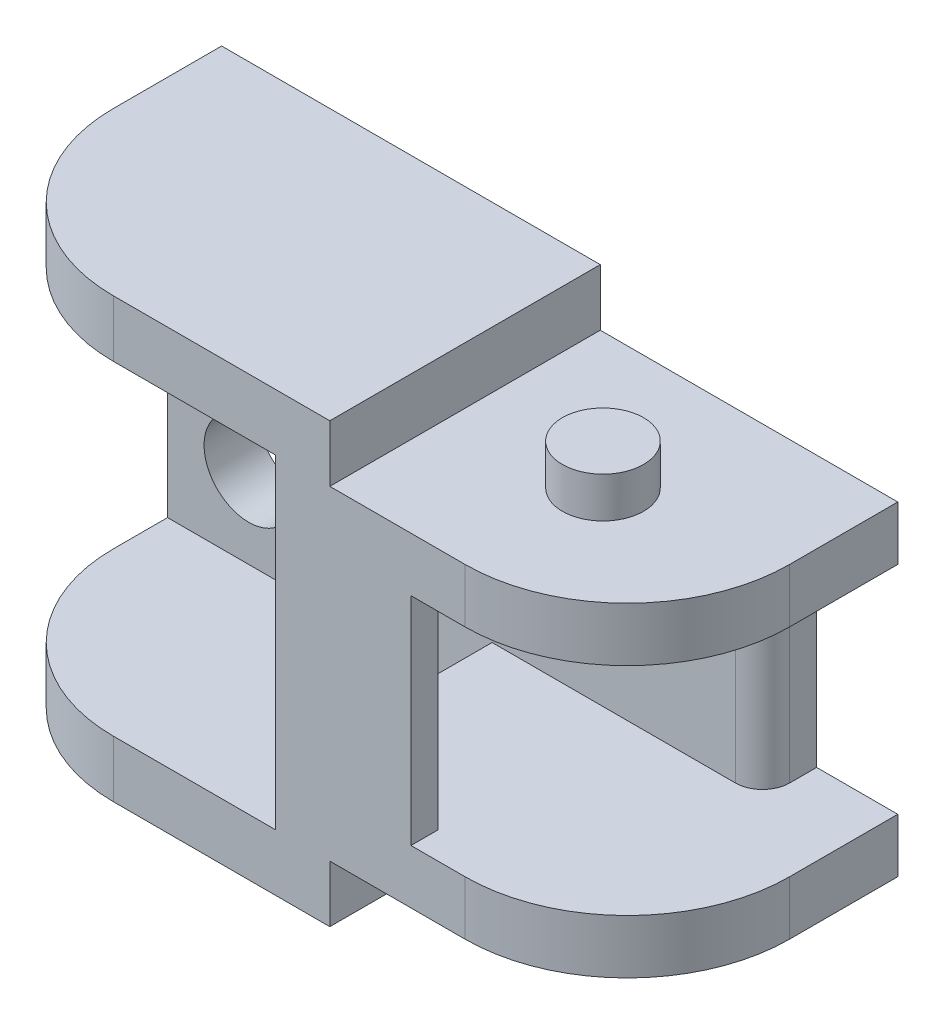
ISO-10303-21;
HEADER;
FILE_DESCRIPTION(('STEP AP214'),'2;1');
FILE_NAME('part.step','',(''),(''),'','','');
FILE_SCHEMA(('AUTOMOTIVE_DESIGN { 1 0 10303 214 1 1 1 1 }'));
ENDSEC;
DATA;
#1=APPLICATION_CONTEXT('core data for automotive mechanical design processes');
#2=APPLICATION_PROTOCOL_DEFINITION('international standard','automotive_design',2000,#1);
#3=PRODUCT_CONTEXT('',#1,'mechanical');
#4=PRODUCT('Part','Part','',(#3));
#5=PRODUCT_RELATED_PRODUCT_CATEGORY('part','',(#4));
#6=PRODUCT_DEFINITION_FORMATION('','',#4);
#7=PRODUCT_DEFINITION_CONTEXT('part definition',#1,'design');
#8=PRODUCT_DEFINITION('design','',#6,#7);
#9=PRODUCT_DEFINITION_SHAPE('','',#8);
#10=(LENGTH_UNIT() NAMED_UNIT(*) SI_UNIT(.MILLI.,.METRE.));
#11=(NAMED_UNIT(*) PLANE_ANGLE_UNIT() SI_UNIT($,.RADIAN.));
#12=(NAMED_UNIT(*) SI_UNIT($,.STERADIAN.) SOLID_ANGLE_UNIT());
#13=UNCERTAINTY_MEASURE_WITH_UNIT(LENGTH_MEASURE(1.E-05),#10,'distance_accuracy_value','');
#14=(GEOMETRIC_REPRESENTATION_CONTEXT(3) GLOBAL_UNCERTAINTY_ASSIGNED_CONTEXT((#13)) GLOBAL_UNIT_ASSIGNED_CONTEXT((#10,
#11,#12)) REPRESENTATION_CONTEXT('',''));
#15=CARTESIAN_POINT('',(0.,0.,0.));
#16=DIRECTION('',(0.,0.,1.));
#17=DIRECTION('',(1.,0.,0.));
#18=AXIS2_PLACEMENT_3D('',#15,#16,#17);
#19=CARTESIAN_POINT('',(24.,-2.1,10.));
#20=DIRECTION('',(0.,1.,0.));
#21=DIRECTION('',(-1.,0.,0.));
#22=AXIS2_PLACEMENT_3D('',#19,#20,#21);
#23=PLANE('',#22);
#24=DIRECTION('',(1.,0.,0.));
#25=VECTOR('',#24,1.);
#26=CARTESIAN_POINT('',(11.,-2.1,9.));
#27=LINE('',#26,#25);
#28=CARTESIAN_POINT('',(11.,-2.1,9.));
#29=VERTEX_POINT('',#28);
#30=CARTESIAN_POINT('',(16.,-2.1,9.));
#31=VERTEX_POINT('',#30);
#32=EDGE_CURVE('E360',#29,#31,#27,.T.);
#33=ORIENTED_EDGE('',*,*,#32,.F.);
#34=DIRECTION('',(0.,0.,-1.));
#35=VECTOR('',#34,1.);
#36=CARTESIAN_POINT('',(11.,-2.1,10.));
#37=LINE('',#36,#35);
#38=CARTESIAN_POINT('',(11.,-2.1,2.));
#39=VERTEX_POINT('',#38);
#40=EDGE_CURVE('E263',#29,#39,#37,.T.);
#41=ORIENTED_EDGE('',*,*,#40,.T.);
#42=DIRECTION('',(-1.,0.,0.));
#43=VECTOR('',#42,1.);
#44=CARTESIAN_POINT('',(24.,-2.1,2.));
#45=LINE('',#44,#43);
#46=CARTESIAN_POINT('',(20.,-2.1,2.));
#47=VERTEX_POINT('',#46);
#48=EDGE_CURVE('E374',#47,#39,#45,.T.);
#49=ORIENTED_EDGE('',*,*,#48,.F.);
#50=CARTESIAN_POINT('',(20.,-2.1,1.));
#51=DIRECTION('',(0.,1.,0.));
#52=DIRECTION('',(-1.,0.,0.));
#53=AXIS2_PLACEMENT_3D('',#50,#51,#52);
#54=CIRCLE('',#53,1.);
#55=CARTESIAN_POINT('',(21.,-2.1,1.));
#56=VERTEX_POINT('',#55);
#57=EDGE_CURVE('E50',#47,#56,#54,.T.);
#58=ORIENTED_EDGE('',*,*,#57,.T.);
#59=DIRECTION('',(0.,0.,1.));
#60=VECTOR('',#59,1.);
#61=CARTESIAN_POINT('',(21.,-2.1,0.));
#62=LINE('',#61,#60);
#63=CARTESIAN_POINT('',(21.,-2.1,0.));
#64=VERTEX_POINT('',#63);
#65=EDGE_CURVE('E371',#64,#56,#62,.T.);
#66=ORIENTED_EDGE('',*,*,#65,.F.);
#67=DIRECTION('',(1.,0.,0.));
#68=VECTOR('',#67,1.);
#69=CARTESIAN_POINT('',(24.,-2.1,0.));
#70=LINE('',#69,#68);
#71=CARTESIAN_POINT('',(24.,-2.1,0.));
#72=VERTEX_POINT('',#71);
#73=EDGE_CURVE('E400',#64,#72,#70,.T.);
#74=ORIENTED_EDGE('',*,*,#73,.T.);
#75=DIRECTION('',(0.,0.,-1.));
#76=VECTOR('',#75,1.);
#77=CARTESIAN_POINT('',(24.,-2.1,10.));
#78=LINE('',#77,#76);
#79=CARTESIAN_POINT('',(24.,-2.1,4.));
#80=VERTEX_POINT('',#79);
#81=EDGE_CURVE('E426',#80,#72,#78,.T.);
#82=ORIENTED_EDGE('',*,*,#81,.F.);
#83=CARTESIAN_POINT('',(18.,-2.1,4.));
#84=DIRECTION('',(0.,1.,0.));
#85=DIRECTION('',(-1.,0.,0.));
#86=AXIS2_PLACEMENT_3D('',#83,#84,#85);
#87=CIRCLE('',#86,6.);
#88=CARTESIAN_POINT('',(18.,-2.1,10.));
#89=VERTEX_POINT('',#88);
#90=EDGE_CURVE('E444',#80,#89,#87,.F.);
#91=ORIENTED_EDGE('',*,*,#90,.T.);
#92=DIRECTION('',(1.,0.,0.));
#93=VECTOR('',#92,1.);
#94=CARTESIAN_POINT('',(24.,-2.1,10.));
#95=LINE('',#94,#93);
#96=CARTESIAN_POINT('',(16.,-2.1,10.));
#97=VERTEX_POINT('',#96);
#98=EDGE_CURVE('E385',#97,#89,#95,.T.);
#99=ORIENTED_EDGE('',*,*,#98,.F.);
#100=DIRECTION('',(0.,0.,1.));
#101=VECTOR('',#100,1.);
#102=CARTESIAN_POINT('',(16.,-2.1,9.));
#103=LINE('',#102,#101);
#104=EDGE_CURVE('E357',#31,#97,#103,.T.);
#105=ORIENTED_EDGE('',*,*,#104,.F.);
#106=EDGE_LOOP('',(#33,#41,#49,#58,#66,#74,#82,#91,#99,#105));
#107=FACE_BOUND('',#106,.T.);
#108=ADVANCED_FACE('F41',(#107),#23,.F.);
#109=CARTESIAN_POINT('',(-1.,-2.1,10.));
#110=DIRECTION('',(1.,0.,0.));
#111=DIRECTION('',(0.,0.,-1.));
#112=AXIS2_PLACEMENT_3D('',#109,#110,#111);
#113=PLANE('',#112);
#114=DIRECTION('',(0.,0.,-1.));
#115=VECTOR('',#114,1.);
#116=CARTESIAN_POINT('',(-1.,-14.2,10.));
#117=LINE('',#116,#115);
#118=CARTESIAN_POINT('',(-1.,-14.2,4.));
#119=VERTEX_POINT('',#118);
#120=CARTESIAN_POINT('',(-1.,-14.2,0.));
#121=VERTEX_POINT('',#120);
#122=EDGE_CURVE('E448',#119,#121,#117,.T.);
#123=ORIENTED_EDGE('',*,*,#122,.F.);
#124=DIRECTION('',(0.,-1.,0.));
#125=VECTOR('',#124,1.);
#126=CARTESIAN_POINT('',(-1.,-2.1,4.));
#127=LINE('',#126,#125);
#128=CARTESIAN_POINT('',(-1.,-12.1,4.));
#129=VERTEX_POINT('',#128);
#130=EDGE_CURVE('E471',#119,#129,#127,.F.);
#131=ORIENTED_EDGE('',*,*,#130,.T.);
#132=DIRECTION('',(0.,0.,-1.));
#133=VECTOR('',#132,1.);
#134=CARTESIAN_POINT('',(-1.,-12.1,10.));
#135=LINE('',#134,#133);
#136=CARTESIAN_POINT('',(-1.,-12.1,2.));
#137=VERTEX_POINT('',#136);
#138=EDGE_CURVE('E267',#129,#137,#135,.T.);
#139=ORIENTED_EDGE('',*,*,#138,.T.);
#140=DIRECTION('',(0.,1.,0.));
#141=VECTOR('',#140,1.);
#142=CARTESIAN_POINT('',(-1.,-2.1,2.));
#143=LINE('',#142,#141);
#144=CARTESIAN_POINT('',(-1.,-0.0999999999999994,2.));
#145=VERTEX_POINT('',#144);
#146=EDGE_CURVE('E379',#137,#145,#143,.T.);
#147=ORIENTED_EDGE('',*,*,#146,.T.);
#148=DIRECTION('',(0.,0.,1.));
#149=VECTOR('',#148,1.);
#150=CARTESIAN_POINT('',(-1.,-0.0999999999999994,10.));
#151=LINE('',#150,#149);
#152=CARTESIAN_POINT('',(-1.,-0.0999999999999994,4.));
#153=VERTEX_POINT('',#152);
#154=EDGE_CURVE('E270',#145,#153,#151,.T.);
#155=ORIENTED_EDGE('',*,*,#154,.T.);
#156=DIRECTION('',(0.,-1.,0.));
#157=VECTOR('',#156,1.);
#158=CARTESIAN_POINT('',(-1.,-2.1,4.));
#159=LINE('',#158,#157);
#160=CARTESIAN_POINT('',(-1.,2.,4.));
#161=VERTEX_POINT('',#160);
#162=EDGE_CURVE('E468',#153,#161,#159,.F.);
#163=ORIENTED_EDGE('',*,*,#162,.T.);
#164=DIRECTION('',(0.,0.,1.));
#165=VECTOR('',#164,1.);
#166=CARTESIAN_POINT('',(-1.,2.,10.));
#167=LINE('',#166,#165);
#168=CARTESIAN_POINT('',(-1.,2.,0.));
#169=VERTEX_POINT('',#168);
#170=EDGE_CURVE('E274',#169,#161,#167,.T.);
#171=ORIENTED_EDGE('',*,*,#170,.F.);
#172=DIRECTION('',(0.,-1.,0.));
#173=VECTOR('',#172,1.);
#174=CARTESIAN_POINT('',(-1.,0.,0.));
#175=LINE('',#174,#173);
#176=EDGE_CURVE('E384',#169,#121,#175,.T.);
#177=ORIENTED_EDGE('',*,*,#176,.T.);
#178=EDGE_LOOP('',(#123,#131,#139,#147,#155,#163,#171,#177));
#179=FACE_BOUND('',#178,.T.);
#180=ADVANCED_FACE('F570',(#179),#113,.F.);
#181=CARTESIAN_POINT('',(24.,-0.0999999999999997,10.));
#182=DIRECTION('',(-1.,0.,0.));
#183=DIRECTION('',(0.,0.,1.));
#184=AXIS2_PLACEMENT_3D('',#181,#182,#183);
#185=PLANE('',#184);
#186=DIRECTION('',(0.,0.,-1.));
#187=VECTOR('',#186,1.);
#188=CARTESIAN_POINT('',(24.,-0.0999999999999997,10.));
#189=LINE('',#188,#187);
#190=CARTESIAN_POINT('',(24.,-0.0999999999999997,4.));
#191=VERTEX_POINT('',#190);
#192=CARTESIAN_POINT('',(24.,-0.0999999999999997,0.));
#193=VERTEX_POINT('',#192);
#194=EDGE_CURVE('E423',#191,#193,#189,.T.);
#195=ORIENTED_EDGE('',*,*,#194,.F.);
#196=DIRECTION('',(0.,1.,0.));
#197=VECTOR('',#196,1.);
#198=CARTESIAN_POINT('',(24.,-0.0999999999999997,4.));
#199=LINE('',#198,#197);
#200=EDGE_CURVE('E441',#191,#80,#199,.F.);
#201=ORIENTED_EDGE('',*,*,#200,.T.);
#202=ORIENTED_EDGE('',*,*,#81,.T.);
#203=DIRECTION('',(0.,1.,0.));
#204=VECTOR('',#203,1.);
#205=CARTESIAN_POINT('',(24.,-0.0999999999999997,0.));
#206=LINE('',#205,#204);
#207=EDGE_CURVE('E403',#72,#193,#206,.T.);
#208=ORIENTED_EDGE('',*,*,#207,.T.);
#209=EDGE_LOOP('',(#195,#201,#202,#208));
#210=FACE_BOUND('',#209,.T.);
#211=ADVANCED_FACE('F546',(#210),#185,.F.);
#212=CARTESIAN_POINT('',(13.,-0.0999999999999997,10.));
#213=DIRECTION('',(0.,-1.,0.));
#214=DIRECTION('',(0.,0.,-1.));
#215=AXIS2_PLACEMENT_3D('',#212,#213,#214);
#216=PLANE('',#215);
#217=CARTESIAN_POINT('',(18.1,-0.0999999999999998,5.));
#218=DIRECTION('',(0.,-1.,0.));
#219=DIRECTION('',(0.,0.,-1.));
#220=AXIS2_PLACEMENT_3D('',#217,#218,#219);
#221=CIRCLE('',#220,1.5);
#222=CARTESIAN_POINT('',(18.1,-0.0999999999999998,3.5));
#223=VERTEX_POINT('',#222);
#224=EDGE_CURVE('E430',#223,#223,#221,.F.);
#225=ORIENTED_EDGE('',*,*,#224,.F.);
#226=EDGE_LOOP('',(#225));
#227=FACE_BOUND('',#226,.T.);
#228=DIRECTION('',(-1.,0.,0.));
#229=VECTOR('',#228,1.);
#230=CARTESIAN_POINT('',(13.,-0.0999999999999997,10.));
#231=LINE('',#230,#229);
#232=CARTESIAN_POINT('',(18.,-0.0999999999999997,10.));
#233=VERTEX_POINT('',#232);
#234=CARTESIAN_POINT('',(13.,-0.0999999999999997,10.));
#235=VERTEX_POINT('',#234);
#236=EDGE_CURVE('E388',#233,#235,#231,.T.);
#237=ORIENTED_EDGE('',*,*,#236,.F.);
#238=CARTESIAN_POINT('',(18.,-0.0999999999999997,4.));
#239=DIRECTION('',(0.,-1.,0.));
#240=DIRECTION('',(0.,0.,-1.));
#241=AXIS2_PLACEMENT_3D('',#238,#239,#240);
#242=CIRCLE('',#241,6.);
#243=EDGE_CURVE('E438',#233,#191,#242,.F.);
#244=ORIENTED_EDGE('',*,*,#243,.T.);
#245=ORIENTED_EDGE('',*,*,#194,.T.);
#246=DIRECTION('',(-1.,0.,0.));
#247=VECTOR('',#246,1.);
#248=CARTESIAN_POINT('',(13.,-0.0999999999999997,0.));
#249=LINE('',#248,#247);
#250=CARTESIAN_POINT('',(13.,-0.0999999999999997,0.));
#251=VERTEX_POINT('',#250);
#252=EDGE_CURVE('E407',#193,#251,#249,.T.);
#253=ORIENTED_EDGE('',*,*,#252,.T.);
#254=DIRECTION('',(0.,0.,-1.));
#255=VECTOR('',#254,1.);
#256=CARTESIAN_POINT('',(13.,-0.0999999999999997,10.));
#257=LINE('',#256,#255);
#258=EDGE_CURVE('E419',#235,#251,#257,.T.);
#259=ORIENTED_EDGE('',*,*,#258,.F.);
#260=EDGE_LOOP('',(#237,#244,#245,#253,#259));
#261=FACE_BOUND('',#260,.T.);
#262=ADVANCED_FACE('F819',(#227,#261),#216,.F.);
#263=CARTESIAN_POINT('',(13.,2.,10.));
#264=DIRECTION('',(-1.,0.,0.));
#265=DIRECTION('',(0.,0.,1.));
#266=AXIS2_PLACEMENT_3D('',#263,#264,#265);
#267=PLANE('',#266);
#268=DIRECTION('',(0.,1.,0.));
#269=VECTOR('',#268,1.);
#270=CARTESIAN_POINT('',(13.,2.,0.));
#271=LINE('',#270,#269);
#272=CARTESIAN_POINT('',(13.,2.,0.));
#273=VERTEX_POINT('',#272);
#274=EDGE_CURVE('E410',#251,#273,#271,.T.);
#275=ORIENTED_EDGE('',*,*,#274,.T.);
#276=DIRECTION('',(0.,0.,-1.));
#277=VECTOR('',#276,1.);
#278=CARTESIAN_POINT('',(13.,2.,10.));
#279=LINE('',#278,#277);
#280=CARTESIAN_POINT('',(13.,2.,10.));
#281=VERTEX_POINT('',#280);
#282=EDGE_CURVE('E399',#281,#273,#279,.T.);
#283=ORIENTED_EDGE('',*,*,#282,.F.);
#284=DIRECTION('',(0.,1.,0.));
#285=VECTOR('',#284,1.);
#286=CARTESIAN_POINT('',(13.,2.,10.));
#287=LINE('',#286,#285);
#288=EDGE_CURVE('E392',#235,#281,#287,.T.);
#289=ORIENTED_EDGE('',*,*,#288,.F.);
#290=ORIENTED_EDGE('',*,*,#258,.T.);
#291=EDGE_LOOP('',(#275,#283,#289,#290));
#292=FACE_BOUND('',#291,.T.);
#293=ADVANCED_FACE('F583',(#292),#267,.F.);
#294=CARTESIAN_POINT('',(0.,2.,10.));
#295=DIRECTION('',(0.,-1.,0.));
#296=DIRECTION('',(1.,0.,0.));
#297=AXIS2_PLACEMENT_3D('',#294,#295,#296);
#298=PLANE('',#297);
#299=ORIENTED_EDGE('',*,*,#170,.T.);
#300=CARTESIAN_POINT('',(5.,2.,4.));
#301=DIRECTION('',(0.,-1.,0.));
#302=DIRECTION('',(1.,0.,0.));
#303=AXIS2_PLACEMENT_3D('',#300,#301,#302);
#304=CIRCLE('',#303,6.);
#305=CARTESIAN_POINT('',(5.,2.,10.));
#306=VERTEX_POINT('',#305);
#307=EDGE_CURVE('E479',#161,#306,#304,.F.);
#308=ORIENTED_EDGE('',*,*,#307,.T.);
#309=DIRECTION('',(-1.,0.,0.));
#310=VECTOR('',#309,1.);
#311=CARTESIAN_POINT('',(0.,2.,10.));
#312=LINE('',#311,#310);
#313=EDGE_CURVE('E395',#281,#306,#312,.T.);
#314=ORIENTED_EDGE('',*,*,#313,.F.);
#315=ORIENTED_EDGE('',*,*,#282,.T.);
#316=DIRECTION('',(-1.,0.,0.));
#317=VECTOR('',#316,1.);
#318=CARTESIAN_POINT('',(0.,2.,0.));
#319=LINE('',#318,#317);
#320=EDGE_CURVE('E389',#273,#169,#319,.T.);
#321=ORIENTED_EDGE('',*,*,#320,.T.);
#322=EDGE_LOOP('',(#299,#308,#314,#315,#321));
#323=FACE_BOUND('',#322,.T.);
#324=ADVANCED_FACE('F578',(#323),#298,.F.);
#325=CARTESIAN_POINT('',(0.,0.,10.));
#326=DIRECTION('',(0.,0.,-1.));
#327=DIRECTION('',(-1.,0.,0.));
#328=AXIS2_PLACEMENT_3D('',#325,#326,#327);
#329=PLANE('',#328);
#330=DIRECTION('',(-1.,0.,0.));
#331=VECTOR('',#330,1.);
#332=CARTESIAN_POINT('',(0.,-12.1,10.));
#333=LINE('',#332,#331);
#334=CARTESIAN_POINT('',(11.,-12.1,10.));
#335=VERTEX_POINT('',#334);
#336=CARTESIAN_POINT('',(5.,-12.1,10.));
#337=VERTEX_POINT('',#336);
#338=EDGE_CURVE('E208',#335,#337,#333,.T.);
#339=ORIENTED_EDGE('',*,*,#338,.T.);
#340=DIRECTION('',(0.,-1.,0.));
#341=VECTOR('',#340,1.);
#342=CARTESIAN_POINT('',(5.,0.,10.));
#343=LINE('',#342,#341);
#344=CARTESIAN_POINT('',(5.,-14.2,10.));
#345=VERTEX_POINT('',#344);
#346=EDGE_CURVE('E462',#337,#345,#343,.T.);
#347=ORIENTED_EDGE('',*,*,#346,.T.);
#348=DIRECTION('',(-1.,0.,0.));
#349=VECTOR('',#348,1.);
#350=CARTESIAN_POINT('',(0.,-14.2,10.));
#351=LINE('',#350,#349);
#352=CARTESIAN_POINT('',(13.,-14.2,10.));
#353=VERTEX_POINT('',#352);
#354=EDGE_CURVE('E302',#353,#345,#351,.T.);
#355=ORIENTED_EDGE('',*,*,#354,.F.);
#356=DIRECTION('',(0.,-1.,0.));
#357=VECTOR('',#356,1.);
#358=CARTESIAN_POINT('',(13.,-14.2,10.));
#359=LINE('',#358,#357);
#360=CARTESIAN_POINT('',(13.,-12.1,10.));
#361=VERTEX_POINT('',#360);
#362=EDGE_CURVE('E298',#361,#353,#359,.T.);
#363=ORIENTED_EDGE('',*,*,#362,.F.);
#364=DIRECTION('',(-1.,0.,0.));
#365=VECTOR('',#364,1.);
#366=CARTESIAN_POINT('',(13.,-12.1,10.));
#367=LINE('',#366,#365);
#368=CARTESIAN_POINT('',(18.,-12.1,10.));
#369=VERTEX_POINT('',#368);
#370=EDGE_CURVE('E293',#369,#361,#367,.T.);
#371=ORIENTED_EDGE('',*,*,#370,.F.);
#372=DIRECTION('',(0.,-1.,0.));
#373=VECTOR('',#372,1.);
#374=CARTESIAN_POINT('',(18.,-12.2,10.));
#375=LINE('',#374,#373);
#376=CARTESIAN_POINT('',(18.,-10.1,10.));
#377=VERTEX_POINT('',#376);
#378=EDGE_CURVE('E344',#377,#369,#375,.T.);
#379=ORIENTED_EDGE('',*,*,#378,.F.);
#380=DIRECTION('',(1.,0.,0.));
#381=VECTOR('',#380,1.);
#382=CARTESIAN_POINT('',(24.,-10.1,10.));
#383=LINE('',#382,#381);
#384=CARTESIAN_POINT('',(16.,-10.1,10.));
#385=VERTEX_POINT('',#384);
#386=EDGE_CURVE('E290',#385,#377,#383,.T.);
#387=ORIENTED_EDGE('',*,*,#386,.F.);
#388=DIRECTION('',(0.,1.,0.));
#389=VECTOR('',#388,1.);
#390=CARTESIAN_POINT('',(16.,-6.1,10.));
#391=LINE('',#390,#389);
#392=EDGE_CURVE('E367',#385,#97,#391,.T.);
#393=ORIENTED_EDGE('',*,*,#392,.T.);
#394=ORIENTED_EDGE('',*,*,#98,.T.);
#395=DIRECTION('',(0.,1.,0.));
#396=VECTOR('',#395,1.);
#397=CARTESIAN_POINT('',(18.,0.,10.));
#398=LINE('',#397,#396);
#399=EDGE_CURVE('E434',#89,#233,#398,.T.);
#400=ORIENTED_EDGE('',*,*,#399,.T.);
#401=ORIENTED_EDGE('',*,*,#236,.T.);
#402=ORIENTED_EDGE('',*,*,#288,.T.);
#403=ORIENTED_EDGE('',*,*,#313,.T.);
#404=DIRECTION('',(0.,-1.,0.));
#405=VECTOR('',#404,1.);
#406=CARTESIAN_POINT('',(5.,0.,10.));
#407=LINE('',#406,#405);
#408=CARTESIAN_POINT('',(5.,-0.0999999999999996,10.));
#409=VERTEX_POINT('',#408);
#410=EDGE_CURVE('E221',#306,#409,#407,.T.);
#411=ORIENTED_EDGE('',*,*,#410,.T.);
#412=DIRECTION('',(-1.,0.,0.));
#413=VECTOR('',#412,1.);
#414=CARTESIAN_POINT('',(-3.18835081881624,-0.0999999999999994,10.));
#415=LINE('',#414,#413);
#416=CARTESIAN_POINT('',(11.,-0.0999999999999997,10.));
#417=VERTEX_POINT('',#416);
#418=EDGE_CURVE('E241',#417,#409,#415,.T.);
#419=ORIENTED_EDGE('',*,*,#418,.F.);
#420=DIRECTION('',(0.,1.,0.));
#421=VECTOR('',#420,1.);
#422=CARTESIAN_POINT('',(11.,-12.1,10.));
#423=LINE('',#422,#421);
#424=EDGE_CURVE('E229',#335,#417,#423,.T.);
#425=ORIENTED_EDGE('',*,*,#424,.F.);
#426=EDGE_LOOP('',(#339,#347,#355,#363,#371,#379,#387,#393,#394,#400,#401,#402,#403,#411,#419,#425));
#427=FACE_BOUND('',#426,.T.);
#428=ADVANCED_FACE('F238',(#427),#329,.F.);
#429=CARTESIAN_POINT('',(0.,0.,0.));
#430=DIRECTION('',(0.,0.,-1.));
#431=DIRECTION('',(-1.,0.,0.));
#432=AXIS2_PLACEMENT_3D('',#429,#430,#431);
#433=PLANE('',#432);
#434=CARTESIAN_POINT('',(2.,-9.1,0.));
#435=DIRECTION('',(0.,0.,1.));
#436=DIRECTION('',(1.,0.,0.));
#437=AXIS2_PLACEMENT_3D('',#434,#435,#436);
#438=CIRCLE('',#437,1.65);
#439=CARTESIAN_POINT('',(3.65,-9.1,0.));
#440=VERTEX_POINT('',#439);
#441=EDGE_CURVE('E243',#440,#440,#438,.T.);
#442=ORIENTED_EDGE('',*,*,#441,.T.);
#443=EDGE_LOOP('',(#442));
#444=FACE_BOUND('',#443,.T.);
#445=CARTESIAN_POINT('',(8.,-3.1,0.));
#446=DIRECTION('',(0.,0.,1.));
#447=DIRECTION('',(1.,0.,0.));
#448=AXIS2_PLACEMENT_3D('',#445,#446,#447);
#449=CIRCLE('',#448,1.65);
#450=CARTESIAN_POINT('',(9.65,-3.1,0.));
#451=VERTEX_POINT('',#450);
#452=EDGE_CURVE('E486',#451,#451,#449,.T.);
#453=ORIENTED_EDGE('',*,*,#452,.T.);
#454=EDGE_LOOP('',(#453));
#455=FACE_BOUND('',#454,.T.);
#456=ORIENTED_EDGE('',*,*,#176,.F.);
#457=ORIENTED_EDGE('',*,*,#320,.F.);
#458=ORIENTED_EDGE('',*,*,#274,.F.);
#459=ORIENTED_EDGE('',*,*,#252,.F.);
#460=ORIENTED_EDGE('',*,*,#207,.F.);
#461=ORIENTED_EDGE('',*,*,#73,.F.);
#462=DIRECTION('',(0.,1.,0.));
#463=VECTOR('',#462,1.);
#464=CARTESIAN_POINT('',(21.,-6.1,0.));
#465=LINE('',#464,#463);
#466=CARTESIAN_POINT('',(21.,-10.1,0.));
#467=VERTEX_POINT('',#466);
#468=EDGE_CURVE('E375',#467,#64,#465,.T.);
#469=ORIENTED_EDGE('',*,*,#468,.F.);
#470=DIRECTION('',(1.,0.,0.));
#471=VECTOR('',#470,1.);
#472=CARTESIAN_POINT('',(24.,-10.1,0.));
#473=LINE('',#472,#471);
#474=CARTESIAN_POINT('',(24.,-10.1,0.));
#475=VERTEX_POINT('',#474);
#476=EDGE_CURVE('E289',#467,#475,#473,.T.);
#477=ORIENTED_EDGE('',*,*,#476,.T.);
#478=DIRECTION('',(0.,-1.,0.));
#479=VECTOR('',#478,1.);
#480=CARTESIAN_POINT('',(24.,-12.1,0.));
#481=LINE('',#480,#479);
#482=CARTESIAN_POINT('',(24.,-12.1,0.));
#483=VERTEX_POINT('',#482);
#484=EDGE_CURVE('E310',#475,#483,#481,.T.);
#485=ORIENTED_EDGE('',*,*,#484,.T.);
#486=DIRECTION('',(-1.,0.,0.));
#487=VECTOR('',#486,1.);
#488=CARTESIAN_POINT('',(13.,-12.1,0.));
#489=LINE('',#488,#487);
#490=CARTESIAN_POINT('',(13.,-12.1,0.));
#491=VERTEX_POINT('',#490);
#492=EDGE_CURVE('E314',#483,#491,#489,.T.);
#493=ORIENTED_EDGE('',*,*,#492,.T.);
#494=DIRECTION('',(0.,-1.,0.));
#495=VECTOR('',#494,1.);
#496=CARTESIAN_POINT('',(13.,-14.2,0.));
#497=LINE('',#496,#495);
#498=CARTESIAN_POINT('',(13.,-14.2,0.));
#499=VERTEX_POINT('',#498);
#500=EDGE_CURVE('E318',#491,#499,#497,.T.);
#501=ORIENTED_EDGE('',*,*,#500,.T.);
#502=DIRECTION('',(-1.,0.,0.));
#503=VECTOR('',#502,1.);
#504=CARTESIAN_POINT('',(0.,-14.2,0.));
#505=LINE('',#504,#503);
#506=EDGE_CURVE('E294',#499,#121,#505,.T.);
#507=ORIENTED_EDGE('',*,*,#506,.T.);
#508=EDGE_LOOP('',(#456,#457,#458,#459,#460,#461,#469,#477,#485,#493,#501,#507));
#509=FACE_BOUND('',#508,.T.);
#510=ADVANCED_FACE('F515',(#444,#455,#509),#433,.T.);
#511=CARTESIAN_POINT('',(18.1,1.4,5.));
#512=DIRECTION('',(0.,-1.,0.));
#513=DIRECTION('',(0.,0.,-1.));
#514=AXIS2_PLACEMENT_3D('',#511,#512,#513);
#515=CYLINDRICAL_SURFACE('',#514,1.5);
#516=CARTESIAN_POINT('',(18.1,1.4,5.));
#517=DIRECTION('',(0.,1.,0.));
#518=DIRECTION('',(0.,0.,1.));
#519=AXIS2_PLACEMENT_3D('',#516,#517,#518);
#520=CIRCLE('',#519,1.5);
#521=CARTESIAN_POINT('',(18.1,1.4,6.5));
#522=VERTEX_POINT('',#521);
#523=EDGE_CURVE('E380',#522,#522,#520,.T.);
#524=ORIENTED_EDGE('',*,*,#523,.F.);
#525=EDGE_LOOP('',(#524));
#526=FACE_BOUND('',#525,.T.);
#527=ORIENTED_EDGE('',*,*,#224,.T.);
#528=EDGE_LOOP('',(#527));
#529=FACE_BOUND('',#528,.T.);
#530=ADVANCED_FACE('F771',(#526,#529),#515,.T.);
#531=CARTESIAN_POINT('',(18.1,1.4,5.));
#532=DIRECTION('',(0.,1.,0.));
#533=DIRECTION('',(0.,0.,1.));
#534=AXIS2_PLACEMENT_3D('',#531,#532,#533);
#535=PLANE('',#534);
#536=ORIENTED_EDGE('',*,*,#523,.T.);
#537=EDGE_LOOP('',(#536));
#538=FACE_BOUND('',#537,.T.);
#539=ADVANCED_FACE('F625',(#538),#535,.T.);
#540=CARTESIAN_POINT('',(18.,0.,4.));
#541=DIRECTION('',(0.,1.,0.));
#542=DIRECTION('',(0.,0.,1.));
#543=AXIS2_PLACEMENT_3D('',#540,#541,#542);
#544=CYLINDRICAL_SURFACE('',#543,6.);
#545=ORIENTED_EDGE('',*,*,#90,.F.);
#546=ORIENTED_EDGE('',*,*,#200,.F.);
#547=ORIENTED_EDGE('',*,*,#243,.F.);
#548=ORIENTED_EDGE('',*,*,#399,.F.);
#549=EDGE_LOOP('',(#545,#546,#547,#548));
#550=FACE_BOUND('',#549,.T.);
#551=ADVANCED_FACE('F549',(#550),#544,.T.);
#552=CARTESIAN_POINT('',(21.,-6.1,0.));
#553=DIRECTION('',(-1.,0.,0.));
#554=DIRECTION('',(0.,-1.,0.));
#555=AXIS2_PLACEMENT_3D('',#552,#553,#554);
#556=PLANE('',#555);
#557=ORIENTED_EDGE('',*,*,#65,.T.);
#558=DIRECTION('',(0.,1.,0.));
#559=VECTOR('',#558,1.);
#560=CARTESIAN_POINT('',(21.,-6.1,1.));
#561=LINE('',#560,#559);
#562=CARTESIAN_POINT('',(21.,-10.1,1.));
#563=VERTEX_POINT('',#562);
#564=EDGE_CURVE('E57',#56,#563,#561,.F.);
#565=ORIENTED_EDGE('',*,*,#564,.T.);
#566=DIRECTION('',(0.,0.,1.));
#567=VECTOR('',#566,1.);
#568=CARTESIAN_POINT('',(21.,-10.1,0.));
#569=LINE('',#568,#567);
#570=EDGE_CURVE('E282',#467,#563,#569,.T.);
#571=ORIENTED_EDGE('',*,*,#570,.F.);
#572=ORIENTED_EDGE('',*,*,#468,.T.);
#573=EDGE_LOOP('',(#557,#565,#571,#572));
#574=FACE_BOUND('',#573,.T.);
#575=ADVANCED_FACE('F529',(#574),#556,.F.);
#576=CARTESIAN_POINT('',(11.,-6.1,2.));
#577=DIRECTION('',(0.,0.,-1.));
#578=DIRECTION('',(-1.,0.,0.));
#579=AXIS2_PLACEMENT_3D('',#576,#577,#578);
#580=PLANE('',#579);
#581=CARTESIAN_POINT('',(2.,-9.1,2.));
#582=DIRECTION('',(0.,0.,-1.));
#583=DIRECTION('',(-1.,0.,0.));
#584=AXIS2_PLACEMENT_3D('',#581,#582,#583);
#585=CIRCLE('',#584,1.65);
#586=CARTESIAN_POINT('',(0.35,-9.1,2.));
#587=VERTEX_POINT('',#586);
#588=EDGE_CURVE('E252',#587,#587,#585,.F.);
#589=ORIENTED_EDGE('',*,*,#588,.F.);
#590=EDGE_LOOP('',(#589));
#591=FACE_BOUND('',#590,.T.);
#592=CARTESIAN_POINT('',(8.,-3.1,2.));
#593=DIRECTION('',(0.,0.,-1.));
#594=DIRECTION('',(-1.,0.,0.));
#595=AXIS2_PLACEMENT_3D('',#592,#593,#594);
#596=CIRCLE('',#595,1.65);
#597=CARTESIAN_POINT('',(6.35,-3.1,2.));
#598=VERTEX_POINT('',#597);
#599=EDGE_CURVE('E487',#598,#598,#596,.F.);
#600=ORIENTED_EDGE('',*,*,#599,.F.);
#601=EDGE_LOOP('',(#600));
#602=FACE_BOUND('',#601,.T.);
#603=DIRECTION('',(-1.,0.,0.));
#604=VECTOR('',#603,1.);
#605=CARTESIAN_POINT('',(11.,-10.1,2.));
#606=LINE('',#605,#604);
#607=CARTESIAN_POINT('',(20.,-10.1,2.));
#608=VERTEX_POINT('',#607);
#609=CARTESIAN_POINT('',(11.,-10.1,2.));
#610=VERTEX_POINT('',#609);
#611=EDGE_CURVE('E285',#608,#610,#606,.T.);
#612=ORIENTED_EDGE('',*,*,#611,.F.);
#613=DIRECTION('',(0.,1.,0.));
#614=VECTOR('',#613,1.);
#615=CARTESIAN_POINT('',(20.,-6.1,2.));
#616=LINE('',#615,#614);
#617=EDGE_CURVE('E482',#608,#47,#616,.T.);
#618=ORIENTED_EDGE('',*,*,#617,.T.);
#619=ORIENTED_EDGE('',*,*,#48,.T.);
#620=DIRECTION('',(0.,1.,0.));
#621=VECTOR('',#620,1.);
#622=CARTESIAN_POINT('',(11.,-12.1,2.));
#623=LINE('',#622,#621);
#624=CARTESIAN_POINT('',(11.,-0.0999999999999997,2.));
#625=VERTEX_POINT('',#624);
#626=EDGE_CURVE('E235',#39,#625,#623,.T.);
#627=ORIENTED_EDGE('',*,*,#626,.T.);
#628=DIRECTION('',(-1.,0.,0.));
#629=VECTOR('',#628,1.);
#630=CARTESIAN_POINT('',(-3.18835081881624,-0.0999999999999994,2.));
#631=LINE('',#630,#629);
#632=EDGE_CURVE('E248',#625,#145,#631,.T.);
#633=ORIENTED_EDGE('',*,*,#632,.T.);
#634=ORIENTED_EDGE('',*,*,#146,.F.);
#635=DIRECTION('',(1.,0.,0.));
#636=VECTOR('',#635,1.);
#637=CARTESIAN_POINT('',(-3.18835081881624,-12.1,2.));
#638=LINE('',#637,#636);
#639=CARTESIAN_POINT('',(11.,-12.1,2.));
#640=VERTEX_POINT('',#639);
#641=EDGE_CURVE('E236',#137,#640,#638,.T.);
#642=ORIENTED_EDGE('',*,*,#641,.T.);
#643=DIRECTION('',(0.,1.,0.));
#644=VECTOR('',#643,1.);
#645=CARTESIAN_POINT('',(11.,-12.1,2.));
#646=LINE('',#645,#644);
#647=EDGE_CURVE('E233',#640,#610,#646,.T.);
#648=ORIENTED_EDGE('',*,*,#647,.T.);
#649=EDGE_LOOP('',(#612,#618,#619,#627,#633,#634,#642,#648));
#650=FACE_BOUND('',#649,.T.);
#651=ADVANCED_FACE('F525',(#591,#602,#650),#580,.F.);
#652=CARTESIAN_POINT('',(16.,-6.1,9.));
#653=DIRECTION('',(-1.,0.,0.));
#654=DIRECTION('',(0.,-1.,0.));
#655=AXIS2_PLACEMENT_3D('',#652,#653,#654);
#656=PLANE('',#655);
#657=ORIENTED_EDGE('',*,*,#104,.T.);
#658=ORIENTED_EDGE('',*,*,#392,.F.);
#659=DIRECTION('',(0.,0.,1.));
#660=VECTOR('',#659,1.);
#661=CARTESIAN_POINT('',(16.,-10.1,9.));
#662=LINE('',#661,#660);
#663=CARTESIAN_POINT('',(16.,-10.1,9.));
#664=VERTEX_POINT('',#663);
#665=EDGE_CURVE('E275',#664,#385,#662,.T.);
#666=ORIENTED_EDGE('',*,*,#665,.F.);
#667=DIRECTION('',(0.,1.,0.));
#668=VECTOR('',#667,1.);
#669=CARTESIAN_POINT('',(16.,-6.1,9.));
#670=LINE('',#669,#668);
#671=EDGE_CURVE('E363',#664,#31,#670,.T.);
#672=ORIENTED_EDGE('',*,*,#671,.T.);
#673=EDGE_LOOP('',(#657,#658,#666,#672));
#674=FACE_BOUND('',#673,.T.);
#675=ADVANCED_FACE('F528',(#674),#656,.F.);
#676=CARTESIAN_POINT('',(11.,-6.1,9.));
#677=DIRECTION('',(0.,0.,1.));
#678=DIRECTION('',(1.,0.,0.));
#679=AXIS2_PLACEMENT_3D('',#676,#677,#678);
#680=PLANE('',#679);
#681=DIRECTION('',(1.,0.,0.));
#682=VECTOR('',#681,1.);
#683=CARTESIAN_POINT('',(11.,-10.1,9.));
#684=LINE('',#683,#682);
#685=CARTESIAN_POINT('',(11.,-10.1,9.));
#686=VERTEX_POINT('',#685);
#687=EDGE_CURVE('E279',#686,#664,#684,.T.);
#688=ORIENTED_EDGE('',*,*,#687,.F.);
#689=DIRECTION('',(0.,1.,0.));
#690=VECTOR('',#689,1.);
#691=CARTESIAN_POINT('',(11.,-6.1,9.));
#692=LINE('',#691,#690);
#693=EDGE_CURVE('E259',#686,#29,#692,.T.);
#694=ORIENTED_EDGE('',*,*,#693,.T.);
#695=ORIENTED_EDGE('',*,*,#32,.T.);
#696=ORIENTED_EDGE('',*,*,#671,.F.);
#697=EDGE_LOOP('',(#688,#694,#695,#696));
#698=FACE_BOUND('',#697,.T.);
#699=ADVANCED_FACE('F560',(#698),#680,.F.);
#700=CARTESIAN_POINT('',(24.,-10.1,10.));
#701=DIRECTION('',(0.,-1.,0.));
#702=DIRECTION('',(-1.,0.,0.));
#703=AXIS2_PLACEMENT_3D('',#700,#701,#702);
#704=PLANE('',#703);
#705=ORIENTED_EDGE('',*,*,#570,.T.);
#706=CARTESIAN_POINT('',(20.,-10.1,1.));
#707=DIRECTION('',(0.,-1.,0.));
#708=DIRECTION('',(1.,0.,0.));
#709=AXIS2_PLACEMENT_3D('',#706,#707,#708);
#710=CIRCLE('',#709,1.);
#711=EDGE_CURVE('E12',#563,#608,#710,.T.);
#712=ORIENTED_EDGE('',*,*,#711,.T.);
#713=ORIENTED_EDGE('',*,*,#611,.T.);
#714=DIRECTION('',(0.,0.,1.));
#715=VECTOR('',#714,1.);
#716=CARTESIAN_POINT('',(11.,-10.1,10.));
#717=LINE('',#716,#715);
#718=EDGE_CURVE('E222',#610,#686,#717,.T.);
#719=ORIENTED_EDGE('',*,*,#718,.T.);
#720=ORIENTED_EDGE('',*,*,#687,.T.);
#721=ORIENTED_EDGE('',*,*,#665,.T.);
#722=ORIENTED_EDGE('',*,*,#386,.T.);
#723=CARTESIAN_POINT('',(18.,-10.1,4.));
#724=DIRECTION('',(0.,1.,0.));
#725=DIRECTION('',(-1.,0.,0.));
#726=AXIS2_PLACEMENT_3D('',#723,#724,#725);
#727=CIRCLE('',#726,6.);
#728=CARTESIAN_POINT('',(24.,-10.1,4.));
#729=VERTEX_POINT('',#728);
#730=EDGE_CURVE('E353',#729,#377,#727,.F.);
#731=ORIENTED_EDGE('',*,*,#730,.F.);
#732=DIRECTION('',(0.,0.,-1.));
#733=VECTOR('',#732,1.);
#734=CARTESIAN_POINT('',(24.,-10.1,10.));
#735=LINE('',#734,#733);
#736=EDGE_CURVE('E336',#729,#475,#735,.T.);
#737=ORIENTED_EDGE('',*,*,#736,.T.);
#738=ORIENTED_EDGE('',*,*,#476,.F.);
#739=EDGE_LOOP('',(#705,#712,#713,#719,#720,#721,#722,#731,#737,#738));
#740=FACE_BOUND('',#739,.T.);
#741=ADVANCED_FACE('F536',(#740),#704,.F.);
#742=CARTESIAN_POINT('',(24.,-12.1,10.));
#743=DIRECTION('',(-1.,0.,0.));
#744=DIRECTION('',(0.,0.,1.));
#745=AXIS2_PLACEMENT_3D('',#742,#743,#744);
#746=PLANE('',#745);
#747=DIRECTION('',(0.,0.,-1.));
#748=VECTOR('',#747,1.);
#749=CARTESIAN_POINT('',(24.,-12.1,10.));
#750=LINE('',#749,#748);
#751=CARTESIAN_POINT('',(24.,-12.1,4.));
#752=VERTEX_POINT('',#751);
#753=EDGE_CURVE('E332',#752,#483,#750,.T.);
#754=ORIENTED_EDGE('',*,*,#753,.T.);
#755=ORIENTED_EDGE('',*,*,#484,.F.);
#756=ORIENTED_EDGE('',*,*,#736,.F.);
#757=DIRECTION('',(0.,-1.,0.));
#758=VECTOR('',#757,1.);
#759=CARTESIAN_POINT('',(24.,-12.1,4.));
#760=LINE('',#759,#758);
#761=EDGE_CURVE('E350',#752,#729,#760,.F.);
#762=ORIENTED_EDGE('',*,*,#761,.F.);
#763=EDGE_LOOP('',(#754,#755,#756,#762));
#764=FACE_BOUND('',#763,.T.);
#765=ADVANCED_FACE('F605',(#764),#746,.F.);
#766=CARTESIAN_POINT('',(13.,-12.1,10.));
#767=DIRECTION('',(0.,1.,0.));
#768=DIRECTION('',(0.,0.,-1.));
#769=AXIS2_PLACEMENT_3D('',#766,#767,#768);
#770=PLANE('',#769);
#771=CARTESIAN_POINT('',(18.1,-12.1,5.));
#772=DIRECTION('',(0.,-1.,0.));
#773=DIRECTION('',(0.,0.,-1.));
#774=AXIS2_PLACEMENT_3D('',#771,#772,#773);
#775=CIRCLE('',#774,1.5);
#776=CARTESIAN_POINT('',(18.1,-12.1,3.5));
#777=VERTEX_POINT('',#776);
#778=EDGE_CURVE('E340',#777,#777,#775,.F.);
#779=ORIENTED_EDGE('',*,*,#778,.T.);
#780=EDGE_LOOP('',(#779));
#781=FACE_BOUND('',#780,.T.);
#782=ORIENTED_EDGE('',*,*,#370,.T.);
#783=DIRECTION('',(0.,0.,-1.));
#784=VECTOR('',#783,1.);
#785=CARTESIAN_POINT('',(13.,-12.1,10.));
#786=LINE('',#785,#784);
#787=EDGE_CURVE('E328',#361,#491,#786,.T.);
#788=ORIENTED_EDGE('',*,*,#787,.T.);
#789=ORIENTED_EDGE('',*,*,#492,.F.);
#790=ORIENTED_EDGE('',*,*,#753,.F.);
#791=CARTESIAN_POINT('',(18.,-12.1,4.));
#792=DIRECTION('',(0.,-1.,0.));
#793=DIRECTION('',(0.,0.,-1.));
#794=AXIS2_PLACEMENT_3D('',#791,#792,#793);
#795=CIRCLE('',#794,6.);
#796=EDGE_CURVE('E347',#369,#752,#795,.F.);
#797=ORIENTED_EDGE('',*,*,#796,.F.);
#798=EDGE_LOOP('',(#782,#788,#789,#790,#797));
#799=FACE_BOUND('',#798,.T.);
#800=ADVANCED_FACE('F598',(#781,#799),#770,.F.);
#801=CARTESIAN_POINT('',(13.,-14.2,10.));
#802=DIRECTION('',(-1.,0.,0.));
#803=DIRECTION('',(0.,0.,1.));
#804=AXIS2_PLACEMENT_3D('',#801,#802,#803);
#805=PLANE('',#804);
#806=ORIENTED_EDGE('',*,*,#500,.F.);
#807=ORIENTED_EDGE('',*,*,#787,.F.);
#808=ORIENTED_EDGE('',*,*,#362,.T.);
#809=DIRECTION('',(0.,0.,-1.));
#810=VECTOR('',#809,1.);
#811=CARTESIAN_POINT('',(13.,-14.2,10.));
#812=LINE('',#811,#810);
#813=EDGE_CURVE('E306',#353,#499,#812,.T.);
#814=ORIENTED_EDGE('',*,*,#813,.T.);
#815=EDGE_LOOP('',(#806,#807,#808,#814));
#816=FACE_BOUND('',#815,.T.);
#817=ADVANCED_FACE('F594',(#816),#805,.F.);
#818=CARTESIAN_POINT('',(0.,-14.2,10.));
#819=DIRECTION('',(0.,1.,0.));
#820=DIRECTION('',(1.,0.,0.));
#821=AXIS2_PLACEMENT_3D('',#818,#819,#820);
#822=PLANE('',#821);
#823=ORIENTED_EDGE('',*,*,#354,.T.);
#824=CARTESIAN_POINT('',(5.,-14.2,4.));
#825=DIRECTION('',(0.,1.,0.));
#826=DIRECTION('',(-1.,0.,0.));
#827=AXIS2_PLACEMENT_3D('',#824,#825,#826);
#828=CIRCLE('',#827,6.);
#829=EDGE_CURVE('E465',#345,#119,#828,.F.);
#830=ORIENTED_EDGE('',*,*,#829,.T.);
#831=ORIENTED_EDGE('',*,*,#122,.T.);
#832=ORIENTED_EDGE('',*,*,#506,.F.);
#833=ORIENTED_EDGE('',*,*,#813,.F.);
#834=EDGE_LOOP('',(#823,#830,#831,#832,#833));
#835=FACE_BOUND('',#834,.T.);
#836=ADVANCED_FACE('F591',(#835),#822,.F.);
#837=CARTESIAN_POINT('',(18.1,-13.6,5.));
#838=DIRECTION('',(0.,1.,0.));
#839=DIRECTION('',(0.,0.,-1.));
#840=AXIS2_PLACEMENT_3D('',#837,#838,#839);
#841=CYLINDRICAL_SURFACE('',#840,1.5);
#842=CARTESIAN_POINT('',(18.1,-13.6,5.));
#843=DIRECTION('',(0.,1.,0.));
#844=DIRECTION('',(0.,0.,1.));
#845=AXIS2_PLACEMENT_3D('',#842,#843,#844);
#846=CIRCLE('',#845,1.5);
#847=CARTESIAN_POINT('',(18.1,-13.6,6.5));
#848=VERTEX_POINT('',#847);
#849=EDGE_CURVE('E286',#848,#848,#846,.T.);
#850=ORIENTED_EDGE('',*,*,#849,.T.);
#851=EDGE_LOOP('',(#850));
#852=FACE_BOUND('',#851,.T.);
#853=ORIENTED_EDGE('',*,*,#778,.F.);
#854=EDGE_LOOP('',(#853));
#855=FACE_BOUND('',#854,.T.);
#856=ADVANCED_FACE('F692',(#852,#855),#841,.T.);
#857=CARTESIAN_POINT('',(18.1,-13.6,5.));
#858=DIRECTION('',(0.,-1.,0.));
#859=DIRECTION('',(0.,0.,1.));
#860=AXIS2_PLACEMENT_3D('',#857,#858,#859);
#861=PLANE('',#860);
#862=ORIENTED_EDGE('',*,*,#849,.F.);
#863=EDGE_LOOP('',(#862));
#864=FACE_BOUND('',#863,.T.);
#865=ADVANCED_FACE('F686',(#864),#861,.T.);
#866=CARTESIAN_POINT('',(18.,-12.2,4.));
#867=DIRECTION('',(0.,-1.,0.));
#868=DIRECTION('',(0.,0.,1.));
#869=AXIS2_PLACEMENT_3D('',#866,#867,#868);
#870=CYLINDRICAL_SURFACE('',#869,6.);
#871=ORIENTED_EDGE('',*,*,#730,.T.);
#872=ORIENTED_EDGE('',*,*,#378,.T.);
#873=ORIENTED_EDGE('',*,*,#796,.T.);
#874=ORIENTED_EDGE('',*,*,#761,.T.);
#875=EDGE_LOOP('',(#871,#872,#873,#874));
#876=FACE_BOUND('',#875,.T.);
#877=ADVANCED_FACE('F602',(#876),#870,.T.);
#878=CARTESIAN_POINT('',(-3.18835081881624,-0.0999999999999994,-17.5824998037886));
#879=DIRECTION('',(0.,1.,0.));
#880=DIRECTION('',(-1.,0.,0.));
#881=AXIS2_PLACEMENT_3D('',#878,#879,#880);
#882=PLANE('',#881);
#883=ORIENTED_EDGE('',*,*,#418,.T.);
#884=CARTESIAN_POINT('',(5.,-0.0999999999999996,4.));
#885=DIRECTION('',(0.,1.,0.));
#886=DIRECTION('',(-1.,0.,0.));
#887=AXIS2_PLACEMENT_3D('',#884,#885,#886);
#888=CIRCLE('',#887,6.);
#889=EDGE_CURVE('E476',#409,#153,#888,.F.);
#890=ORIENTED_EDGE('',*,*,#889,.T.);
#891=ORIENTED_EDGE('',*,*,#154,.F.);
#892=ORIENTED_EDGE('',*,*,#632,.F.);
#893=DIRECTION('',(0.,0.,1.));
#894=VECTOR('',#893,1.);
#895=CARTESIAN_POINT('',(11.,-0.0999999999999997,-17.5824998037886));
#896=LINE('',#895,#894);
#897=EDGE_CURVE('E256',#625,#417,#896,.T.);
#898=ORIENTED_EDGE('',*,*,#897,.T.);
#899=EDGE_LOOP('',(#883,#890,#891,#892,#898));
#900=FACE_BOUND('',#899,.T.);
#901=ADVANCED_FACE('F566',(#900),#882,.F.);
#902=CARTESIAN_POINT('',(-3.18835081881624,-12.1,-17.5824998037886));
#903=DIRECTION('',(0.,-1.,0.));
#904=DIRECTION('',(0.,0.,-1.));
#905=AXIS2_PLACEMENT_3D('',#902,#903,#904);
#906=PLANE('',#905);
#907=ORIENTED_EDGE('',*,*,#138,.F.);
#908=CARTESIAN_POINT('',(5.,-12.1,4.));
#909=DIRECTION('',(0.,-1.,0.));
#910=DIRECTION('',(0.,0.,-1.));
#911=AXIS2_PLACEMENT_3D('',#908,#909,#910);
#912=CIRCLE('',#911,6.);
#913=EDGE_CURVE('E215',#129,#337,#912,.F.);
#914=ORIENTED_EDGE('',*,*,#913,.T.);
#915=ORIENTED_EDGE('',*,*,#338,.F.);
#916=DIRECTION('',(0.,0.,1.));
#917=VECTOR('',#916,1.);
#918=CARTESIAN_POINT('',(11.,-12.1,-17.5824998037886));
#919=LINE('',#918,#917);
#920=EDGE_CURVE('E213',#640,#335,#919,.T.);
#921=ORIENTED_EDGE('',*,*,#920,.F.);
#922=ORIENTED_EDGE('',*,*,#641,.F.);
#923=EDGE_LOOP('',(#907,#914,#915,#921,#922));
#924=FACE_BOUND('',#923,.T.);
#925=ADVANCED_FACE('F211',(#924),#906,.F.);
#926=CARTESIAN_POINT('',(11.,-12.1,-17.5824998037886));
#927=DIRECTION('',(1.,0.,0.));
#928=DIRECTION('',(0.,0.,-1.));
#929=AXIS2_PLACEMENT_3D('',#926,#927,#928);
#930=PLANE('',#929);
#931=ORIENTED_EDGE('',*,*,#693,.F.);
#932=ORIENTED_EDGE('',*,*,#718,.F.);
#933=ORIENTED_EDGE('',*,*,#647,.F.);
#934=ORIENTED_EDGE('',*,*,#920,.T.);
#935=ORIENTED_EDGE('',*,*,#424,.T.);
#936=ORIENTED_EDGE('',*,*,#897,.F.);
#937=ORIENTED_EDGE('',*,*,#626,.F.);
#938=ORIENTED_EDGE('',*,*,#40,.F.);
#939=EDGE_LOOP('',(#931,#932,#933,#934,#935,#936,#937,#938));
#940=FACE_BOUND('',#939,.T.);
#941=ADVANCED_FACE('F227',(#940),#930,.F.);
#942=CARTESIAN_POINT('',(8.,-3.1,0.));
#943=DIRECTION('',(0.,0.,1.));
#944=DIRECTION('',(1.,0.,0.));
#945=AXIS2_PLACEMENT_3D('',#942,#943,#944);
#946=CYLINDRICAL_SURFACE('',#945,1.65);
#947=ORIENTED_EDGE('',*,*,#452,.F.);
#948=EDGE_LOOP('',(#947));
#949=FACE_BOUND('',#948,.T.);
#950=ORIENTED_EDGE('',*,*,#599,.T.);
#951=EDGE_LOOP('',(#950));
#952=FACE_BOUND('',#951,.T.);
#953=ADVANCED_FACE('F518',(#949,#952),#946,.F.);
#954=CARTESIAN_POINT('',(2.,-9.1,0.));
#955=DIRECTION('',(0.,0.,1.));
#956=DIRECTION('',(1.,0.,0.));
#957=AXIS2_PLACEMENT_3D('',#954,#955,#956);
#958=CYLINDRICAL_SURFACE('',#957,1.65);
#959=ORIENTED_EDGE('',*,*,#441,.F.);
#960=EDGE_LOOP('',(#959));
#961=FACE_BOUND('',#960,.T.);
#962=ORIENTED_EDGE('',*,*,#588,.T.);
#963=EDGE_LOOP('',(#962));
#964=FACE_BOUND('',#963,.T.);
#965=ADVANCED_FACE('F521',(#961,#964),#958,.F.);
#966=CARTESIAN_POINT('',(5.,0.,4.));
#967=DIRECTION('',(0.,-1.,0.));
#968=DIRECTION('',(0.,0.,-1.));
#969=AXIS2_PLACEMENT_3D('',#966,#967,#968);
#970=CYLINDRICAL_SURFACE('',#969,6.);
#971=ORIENTED_EDGE('',*,*,#913,.F.);
#972=ORIENTED_EDGE('',*,*,#130,.F.);
#973=ORIENTED_EDGE('',*,*,#829,.F.);
#974=ORIENTED_EDGE('',*,*,#346,.F.);
#975=EDGE_LOOP('',(#971,#972,#973,#974));
#976=FACE_BOUND('',#975,.T.);
#977=ADVANCED_FACE('F589',(#976),#970,.T.);
#978=CARTESIAN_POINT('',(5.,0.,4.));
#979=DIRECTION('',(0.,-1.,0.));
#980=DIRECTION('',(0.,0.,-1.));
#981=AXIS2_PLACEMENT_3D('',#978,#979,#980);
#982=CYLINDRICAL_SURFACE('',#981,6.);
#983=ORIENTED_EDGE('',*,*,#307,.F.);
#984=ORIENTED_EDGE('',*,*,#162,.F.);
#985=ORIENTED_EDGE('',*,*,#889,.F.);
#986=ORIENTED_EDGE('',*,*,#410,.F.);
#987=EDGE_LOOP('',(#983,#984,#985,#986));
#988=FACE_BOUND('',#987,.T.);
#989=ADVANCED_FACE('F574',(#988),#982,.T.);
#990=CARTESIAN_POINT('',(20.,-6.1,1.));
#991=DIRECTION('',(0.,1.,0.));
#992=DIRECTION('',(-1.,0.,0.));
#993=AXIS2_PLACEMENT_3D('',#990,#991,#992);
#994=CYLINDRICAL_SURFACE('',#993,1.);
#995=ORIENTED_EDGE('',*,*,#711,.F.);
#996=ORIENTED_EDGE('',*,*,#564,.F.);
#997=ORIENTED_EDGE('',*,*,#57,.F.);
#998=ORIENTED_EDGE('',*,*,#617,.F.);
#999=EDGE_LOOP('',(#995,#996,#997,#998));
#1000=FACE_BOUND('',#999,.T.);
#1001=ADVANCED_FACE('F43',(#1000),#994,.T.);
#1002=CLOSED_SHELL('',(#108,#180,#211,#262,#293,#324,#428,#510,#530,#539,#551,#575,#651,#675,
#699,#741,#765,#800,#817,#836,#856,#865,#877,#901,#925,#941,#953,#965,#977,#989,#1001));
#1003=MANIFOLD_SOLID_BREP('B2',#1002);
#1004=ADVANCED_BREP_SHAPE_REPRESENTATION('',(#18,#1003),#14);
#1005=SHAPE_DEFINITION_REPRESENTATION(#9,#1004);
ENDSEC;
END-ISO-10303-21;
